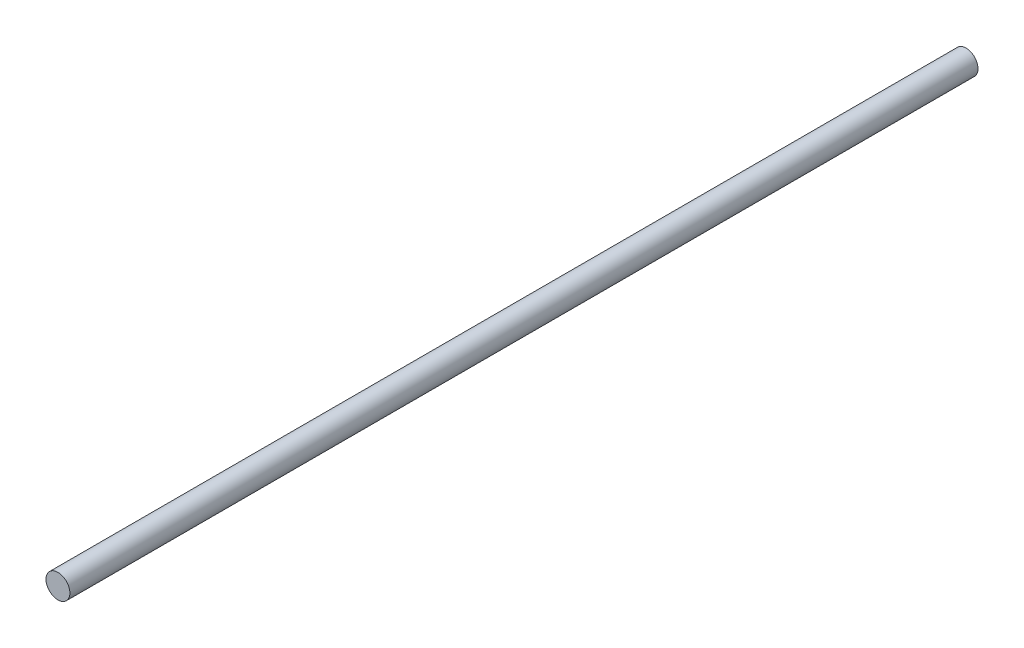
ISO-10303-21;
HEADER;
FILE_DESCRIPTION(('STEP AP214'),'2;1');
FILE_NAME('part.step','',(''),(''),'','','');
FILE_SCHEMA(('AUTOMOTIVE_DESIGN { 1 0 10303 214 1 1 1 1 }'));
ENDSEC;
DATA;
#1=APPLICATION_CONTEXT('core data for automotive mechanical design processes');
#2=APPLICATION_PROTOCOL_DEFINITION('international standard','automotive_design',2000,#1);
#3=PRODUCT_CONTEXT('',#1,'mechanical');
#4=PRODUCT('Part','Part','',(#3));
#5=PRODUCT_RELATED_PRODUCT_CATEGORY('part','',(#4));
#6=PRODUCT_DEFINITION_FORMATION('','',#4);
#7=PRODUCT_DEFINITION_CONTEXT('part definition',#1,'design');
#8=PRODUCT_DEFINITION('design','',#6,#7);
#9=PRODUCT_DEFINITION_SHAPE('','',#8);
#10=(LENGTH_UNIT() NAMED_UNIT(*) SI_UNIT(.MILLI.,.METRE.));
#11=(NAMED_UNIT(*) PLANE_ANGLE_UNIT() SI_UNIT($,.RADIAN.));
#12=(NAMED_UNIT(*) SI_UNIT($,.STERADIAN.) SOLID_ANGLE_UNIT());
#13=UNCERTAINTY_MEASURE_WITH_UNIT(LENGTH_MEASURE(1.E-05),#10,'distance_accuracy_value','');
#14=(GEOMETRIC_REPRESENTATION_CONTEXT(3) GLOBAL_UNCERTAINTY_ASSIGNED_CONTEXT((#13)) GLOBAL_UNIT_ASSIGNED_CONTEXT((#10,
#11,#12)) REPRESENTATION_CONTEXT('',''));
#15=CARTESIAN_POINT('',(0.,0.,0.));
#16=DIRECTION('',(0.,0.,1.));
#17=DIRECTION('',(1.,0.,0.));
#18=AXIS2_PLACEMENT_3D('',#15,#16,#17);
#19=CARTESIAN_POINT('',(0.,0.,380.));
#20=DIRECTION('',(0.,0.,-1.));
#21=DIRECTION('',(-1.,0.,0.));
#22=AXIS2_PLACEMENT_3D('',#19,#20,#21);
#23=CYLINDRICAL_SURFACE('',#22,5.);
#24=CARTESIAN_POINT('',(0.,0.,380.));
#25=DIRECTION('',(0.,0.,1.));
#26=DIRECTION('',(1.,0.,0.));
#27=AXIS2_PLACEMENT_3D('',#24,#25,#26);
#28=CIRCLE('',#27,5.);
#29=CARTESIAN_POINT('',(5.,0.,380.));
#30=VERTEX_POINT('',#29);
#31=EDGE_CURVE('E10',#30,#30,#28,.T.);
#32=ORIENTED_EDGE('',*,*,#31,.F.);
#33=EDGE_LOOP('',(#32));
#34=FACE_BOUND('',#33,.T.);
#35=CARTESIAN_POINT('',(0.,0.,0.));
#36=DIRECTION('',(0.,0.,1.));
#37=DIRECTION('',(1.,0.,0.));
#38=AXIS2_PLACEMENT_3D('',#35,#36,#37);
#39=CIRCLE('',#38,5.);
#40=CARTESIAN_POINT('',(5.,0.,0.));
#41=VERTEX_POINT('',#40);
#42=EDGE_CURVE('E36',#41,#41,#39,.T.);
#43=ORIENTED_EDGE('',*,*,#42,.T.);
#44=EDGE_LOOP('',(#43));
#45=FACE_BOUND('',#44,.T.);
#46=ADVANCED_FACE('F33',(#34,#45),#23,.T.);
#47=CARTESIAN_POINT('',(0.,0.,380.));
#48=DIRECTION('',(0.,0.,1.));
#49=DIRECTION('',(1.,0.,0.));
#50=AXIS2_PLACEMENT_3D('',#47,#48,#49);
#51=PLANE('',#50);
#52=ORIENTED_EDGE('',*,*,#31,.T.);
#53=EDGE_LOOP('',(#52));
#54=FACE_BOUND('',#53,.T.);
#55=ADVANCED_FACE('F48',(#54),#51,.T.);
#56=CARTESIAN_POINT('',(0.,0.,0.));
#57=DIRECTION('',(0.,0.,1.));
#58=DIRECTION('',(1.,0.,0.));
#59=AXIS2_PLACEMENT_3D('',#56,#57,#58);
#60=PLANE('',#59);
#61=ORIENTED_EDGE('',*,*,#42,.F.);
#62=EDGE_LOOP('',(#61));
#63=FACE_BOUND('',#62,.T.);
#64=ADVANCED_FACE('F46',(#63),#60,.F.);
#65=CLOSED_SHELL('',(#46,#55,#64));
#66=MANIFOLD_SOLID_BREP('B2',#65);
#67=ADVANCED_BREP_SHAPE_REPRESENTATION('',(#18,#66),#14);
#68=SHAPE_DEFINITION_REPRESENTATION(#9,#67);
ENDSEC;
END-ISO-10303-21;
